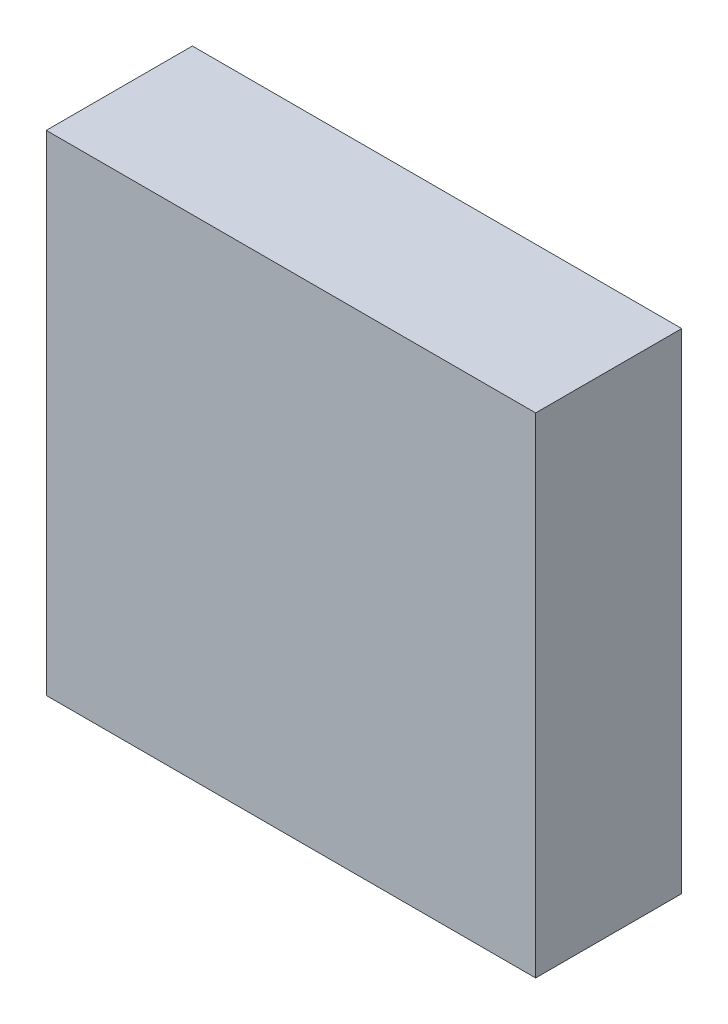
ISO-10303-21;
HEADER;
FILE_DESCRIPTION(('STEP AP214'),'2;1');
FILE_NAME('part.step','',(''),(''),'','','');
FILE_SCHEMA(('AUTOMOTIVE_DESIGN { 1 0 10303 214 1 1 1 1 }'));
ENDSEC;
DATA;
#1=APPLICATION_CONTEXT('core data for automotive mechanical design processes');
#2=APPLICATION_PROTOCOL_DEFINITION('international standard','automotive_design',2000,#1);
#3=PRODUCT_CONTEXT('',#1,'mechanical');
#4=PRODUCT('Part','Part','',(#3));
#5=PRODUCT_RELATED_PRODUCT_CATEGORY('part','',(#4));
#6=PRODUCT_DEFINITION_FORMATION('','',#4);
#7=PRODUCT_DEFINITION_CONTEXT('part definition',#1,'design');
#8=PRODUCT_DEFINITION('design','',#6,#7);
#9=PRODUCT_DEFINITION_SHAPE('','',#8);
#10=(LENGTH_UNIT() NAMED_UNIT(*) SI_UNIT(.MILLI.,.METRE.));
#11=(NAMED_UNIT(*) PLANE_ANGLE_UNIT() SI_UNIT($,.RADIAN.));
#12=(NAMED_UNIT(*) SI_UNIT($,.STERADIAN.) SOLID_ANGLE_UNIT());
#13=UNCERTAINTY_MEASURE_WITH_UNIT(LENGTH_MEASURE(1.E-05),#10,'distance_accuracy_value','');
#14=(GEOMETRIC_REPRESENTATION_CONTEXT(3) GLOBAL_UNCERTAINTY_ASSIGNED_CONTEXT((#13)) GLOBAL_UNIT_ASSIGNED_CONTEXT((#10,
#11,#12)) REPRESENTATION_CONTEXT('',''));
#15=CARTESIAN_POINT('',(0.,0.,0.));
#16=DIRECTION('',(0.,0.,1.));
#17=DIRECTION('',(1.,0.,0.));
#18=AXIS2_PLACEMENT_3D('',#15,#16,#17);
#19=CARTESIAN_POINT('',(8.8,-0.800000000000002,5.1));
#20=DIRECTION('',(1.,0.,0.));
#21=DIRECTION('',(0.,0.,-1.));
#22=AXIS2_PLACEMENT_3D('',#19,#20,#21);
#23=PLANE('',#22);
#24=DIRECTION('',(0.,0.,1.));
#25=VECTOR('',#24,1.);
#26=CARTESIAN_POINT('',(8.8,38.9386210493399,0.1));
#27=LINE('',#26,#25);
#28=CARTESIAN_POINT('',(8.8,38.9386210493399,1.6));
#29=VERTEX_POINT('',#28);
#30=CARTESIAN_POINT('',(8.8,38.9386210493398,5.1));
#31=VERTEX_POINT('',#30);
#32=EDGE_CURVE('E108',#29,#31,#27,.T.);
#33=ORIENTED_EDGE('',*,*,#32,.F.);
#34=DIRECTION('',(0.,1.,0.));
#35=VECTOR('',#34,1.);
#36=CARTESIAN_POINT('',(8.8,-0.800000000000002,1.6));
#37=LINE('',#36,#35);
#38=CARTESIAN_POINT('',(8.8,0.,1.6));
#39=VERTEX_POINT('',#38);
#40=EDGE_CURVE('E100',#39,#29,#37,.T.);
#41=ORIENTED_EDGE('',*,*,#40,.F.);
#42=DIRECTION('',(0.,0.,-1.));
#43=VECTOR('',#42,1.);
#44=CARTESIAN_POINT('',(8.8,0.,12.3));
#45=LINE('',#44,#43);
#46=CARTESIAN_POINT('',(8.8,0.,5.1));
#47=VERTEX_POINT('',#46);
#48=EDGE_CURVE('E129',#47,#39,#45,.T.);
#49=ORIENTED_EDGE('',*,*,#48,.F.);
#50=DIRECTION('',(0.,1.,0.));
#51=VECTOR('',#50,1.);
#52=CARTESIAN_POINT('',(8.8,-0.800000000000002,5.1));
#53=LINE('',#52,#51);
#54=EDGE_CURVE('E111',#47,#31,#53,.T.);
#55=ORIENTED_EDGE('',*,*,#54,.T.);
#56=EDGE_LOOP('',(#33,#41,#49,#55));
#57=FACE_BOUND('',#56,.T.);
#58=ADVANCED_FACE('F33',(#57),#23,.F.);
#59=CARTESIAN_POINT('',(2.2,-0.800000000000002,5.1));
#60=DIRECTION('',(0.,0.,1.));
#61=DIRECTION('',(1.,0.,0.));
#62=AXIS2_PLACEMENT_3D('',#59,#60,#61);
#63=PLANE('',#62);
#64=DIRECTION('',(-1.,0.,0.));
#65=VECTOR('',#64,1.);
#66=CARTESIAN_POINT('',(8.8,38.9386210493399,5.1));
#67=LINE('',#66,#65);
#68=CARTESIAN_POINT('',(2.2,38.9386210493398,5.1));
#69=VERTEX_POINT('',#68);
#70=EDGE_CURVE('E48',#31,#69,#67,.T.);
#71=ORIENTED_EDGE('',*,*,#70,.F.);
#72=ORIENTED_EDGE('',*,*,#54,.F.);
#73=DIRECTION('',(1.,0.,0.));
#74=VECTOR('',#73,1.);
#75=CARTESIAN_POINT('',(0.,0.,5.1));
#76=LINE('',#75,#74);
#77=CARTESIAN_POINT('',(2.2,0.,5.1));
#78=VERTEX_POINT('',#77);
#79=EDGE_CURVE('E126',#78,#47,#76,.T.);
#80=ORIENTED_EDGE('',*,*,#79,.F.);
#81=DIRECTION('',(0.,1.,0.));
#82=VECTOR('',#81,1.);
#83=CARTESIAN_POINT('',(2.2,-0.800000000000002,5.1));
#84=LINE('',#83,#82);
#85=EDGE_CURVE('E119',#78,#69,#84,.T.);
#86=ORIENTED_EDGE('',*,*,#85,.T.);
#87=EDGE_LOOP('',(#71,#72,#80,#86));
#88=FACE_BOUND('',#87,.T.);
#89=ADVANCED_FACE('F189',(#88),#63,.F.);
#90=CARTESIAN_POINT('',(2.2,-0.800000000000002,5.1));
#91=DIRECTION('',(-1.,0.,0.));
#92=DIRECTION('',(0.,0.,1.));
#93=AXIS2_PLACEMENT_3D('',#90,#91,#92);
#94=PLANE('',#93);
#95=DIRECTION('',(0.,0.,1.));
#96=VECTOR('',#95,1.);
#97=CARTESIAN_POINT('',(2.2,38.9386210493399,0.1));
#98=LINE('',#97,#96);
#99=CARTESIAN_POINT('',(2.2,38.9386210493398,1.6));
#100=VERTEX_POINT('',#99);
#101=EDGE_CURVE('E56',#100,#69,#98,.T.);
#102=ORIENTED_EDGE('',*,*,#101,.T.);
#103=ORIENTED_EDGE('',*,*,#85,.F.);
#104=DIRECTION('',(0.,0.,1.));
#105=VECTOR('',#104,1.);
#106=CARTESIAN_POINT('',(2.2,0.,12.3));
#107=LINE('',#106,#105);
#108=CARTESIAN_POINT('',(2.2,0.,1.6));
#109=VERTEX_POINT('',#108);
#110=EDGE_CURVE('E123',#109,#78,#107,.T.);
#111=ORIENTED_EDGE('',*,*,#110,.F.);
#112=DIRECTION('',(0.,1.,0.));
#113=VECTOR('',#112,1.);
#114=CARTESIAN_POINT('',(2.2,-0.800000000000002,1.6));
#115=LINE('',#114,#113);
#116=EDGE_CURVE('E107',#109,#100,#115,.T.);
#117=ORIENTED_EDGE('',*,*,#116,.T.);
#118=EDGE_LOOP('',(#102,#103,#111,#117));
#119=FACE_BOUND('',#118,.T.);
#120=ADVANCED_FACE('F193',(#119),#94,.F.);
#121=CARTESIAN_POINT('',(2.2,-0.800000000000002,1.6));
#122=DIRECTION('',(0.,0.,-1.));
#123=DIRECTION('',(-1.,0.,0.));
#124=AXIS2_PLACEMENT_3D('',#121,#122,#123);
#125=PLANE('',#124);
#126=DIRECTION('',(1.,0.,0.));
#127=VECTOR('',#126,1.);
#128=CARTESIAN_POINT('',(2.2,38.9386210493399,1.6));
#129=LINE('',#128,#127);
#130=EDGE_CURVE('E11',#100,#29,#129,.T.);
#131=ORIENTED_EDGE('',*,*,#130,.F.);
#132=ORIENTED_EDGE('',*,*,#116,.F.);
#133=DIRECTION('',(-1.,0.,0.));
#134=VECTOR('',#133,1.);
#135=CARTESIAN_POINT('',(0.,0.,1.6));
#136=LINE('',#135,#134);
#137=EDGE_CURVE('E104',#39,#109,#136,.T.);
#138=ORIENTED_EDGE('',*,*,#137,.F.);
#139=ORIENTED_EDGE('',*,*,#40,.T.);
#140=EDGE_LOOP('',(#131,#132,#138,#139));
#141=FACE_BOUND('',#140,.T.);
#142=ADVANCED_FACE('F102',(#141),#125,.F.);
#143=CARTESIAN_POINT('',(0.,0.,12.3));
#144=DIRECTION('',(1.,0.,0.));
#145=DIRECTION('',(0.,0.,-1.));
#146=AXIS2_PLACEMENT_3D('',#143,#144,#145);
#147=PLANE('',#146);
#148=DIRECTION('',(0.,-1.,0.));
#149=VECTOR('',#148,1.);
#150=CARTESIAN_POINT('',(0.,0.,0.));
#151=LINE('',#150,#149);
#152=CARTESIAN_POINT('',(0.,41.2,0.));
#153=VERTEX_POINT('',#152);
#154=CARTESIAN_POINT('',(0.,0.,0.));
#155=VERTEX_POINT('',#154);
#156=EDGE_CURVE('E131',#153,#155,#151,.T.);
#157=ORIENTED_EDGE('',*,*,#156,.T.);
#158=DIRECTION('',(0.,0.,-1.));
#159=VECTOR('',#158,1.);
#160=CARTESIAN_POINT('',(0.,0.,12.3));
#161=LINE('',#160,#159);
#162=CARTESIAN_POINT('',(0.,0.,12.3));
#163=VERTEX_POINT('',#162);
#164=EDGE_CURVE('E41',#163,#155,#161,.T.);
#165=ORIENTED_EDGE('',*,*,#164,.F.);
#166=DIRECTION('',(0.,-1.,0.));
#167=VECTOR('',#166,1.);
#168=CARTESIAN_POINT('',(0.,0.,12.3));
#169=LINE('',#168,#167);
#170=CARTESIAN_POINT('',(0.,41.2,12.3));
#171=VERTEX_POINT('',#170);
#172=EDGE_CURVE('E132',#171,#163,#169,.T.);
#173=ORIENTED_EDGE('',*,*,#172,.F.);
#174=DIRECTION('',(0.,0.,-1.));
#175=VECTOR('',#174,1.);
#176=CARTESIAN_POINT('',(0.,41.2,12.3));
#177=LINE('',#176,#175);
#178=EDGE_CURVE('E142',#171,#153,#177,.T.);
#179=ORIENTED_EDGE('',*,*,#178,.T.);
#180=EDGE_LOOP('',(#157,#165,#173,#179));
#181=FACE_BOUND('',#180,.T.);
#182=ADVANCED_FACE('F35',(#181),#147,.F.);
#183=CARTESIAN_POINT('',(0.,0.,12.3));
#184=DIRECTION('',(0.,1.,0.));
#185=DIRECTION('',(0.,0.,1.));
#186=AXIS2_PLACEMENT_3D('',#183,#184,#185);
#187=PLANE('',#186);
#188=ORIENTED_EDGE('',*,*,#79,.T.);
#189=ORIENTED_EDGE('',*,*,#48,.T.);
#190=ORIENTED_EDGE('',*,*,#137,.T.);
#191=ORIENTED_EDGE('',*,*,#110,.T.);
#192=EDGE_LOOP('',(#188,#189,#190,#191));
#193=FACE_BOUND('',#192,.T.);
#194=DIRECTION('',(1.,0.,0.));
#195=VECTOR('',#194,1.);
#196=CARTESIAN_POINT('',(0.,0.,0.));
#197=LINE('',#196,#195);
#198=CARTESIAN_POINT('',(41.2,0.,0.));
#199=VERTEX_POINT('',#198);
#200=EDGE_CURVE('E145',#155,#199,#197,.T.);
#201=ORIENTED_EDGE('',*,*,#200,.T.);
#202=DIRECTION('',(0.,0.,-1.));
#203=VECTOR('',#202,1.);
#204=CARTESIAN_POINT('',(41.2,0.,12.3));
#205=LINE('',#204,#203);
#206=CARTESIAN_POINT('',(41.2,0.,12.3));
#207=VERTEX_POINT('',#206);
#208=EDGE_CURVE('E155',#207,#199,#205,.T.);
#209=ORIENTED_EDGE('',*,*,#208,.F.);
#210=DIRECTION('',(1.,0.,0.));
#211=VECTOR('',#210,1.);
#212=CARTESIAN_POINT('',(0.,0.,12.3));
#213=LINE('',#212,#211);
#214=EDGE_CURVE('E135',#163,#207,#213,.T.);
#215=ORIENTED_EDGE('',*,*,#214,.F.);
#216=ORIENTED_EDGE('',*,*,#164,.T.);
#217=EDGE_LOOP('',(#201,#209,#215,#216));
#218=FACE_BOUND('',#217,.T.);
#219=ADVANCED_FACE('F160',(#193,#218),#187,.F.);
#220=CARTESIAN_POINT('',(41.2,0.,12.3));
#221=DIRECTION('',(-1.,0.,0.));
#222=DIRECTION('',(0.,0.,1.));
#223=AXIS2_PLACEMENT_3D('',#220,#221,#222);
#224=PLANE('',#223);
#225=DIRECTION('',(0.,1.,0.));
#226=VECTOR('',#225,1.);
#227=CARTESIAN_POINT('',(41.2,0.,0.));
#228=LINE('',#227,#226);
#229=CARTESIAN_POINT('',(41.2,41.2,0.));
#230=VERTEX_POINT('',#229);
#231=EDGE_CURVE('E147',#199,#230,#228,.T.);
#232=ORIENTED_EDGE('',*,*,#231,.T.);
#233=DIRECTION('',(0.,0.,-1.));
#234=VECTOR('',#233,1.);
#235=CARTESIAN_POINT('',(41.2,41.2,12.3));
#236=LINE('',#235,#234);
#237=CARTESIAN_POINT('',(41.2,41.2,12.3));
#238=VERTEX_POINT('',#237);
#239=EDGE_CURVE('E152',#238,#230,#236,.T.);
#240=ORIENTED_EDGE('',*,*,#239,.F.);
#241=DIRECTION('',(0.,1.,0.));
#242=VECTOR('',#241,1.);
#243=CARTESIAN_POINT('',(41.2,0.,12.3));
#244=LINE('',#243,#242);
#245=EDGE_CURVE('E138',#207,#238,#244,.T.);
#246=ORIENTED_EDGE('',*,*,#245,.F.);
#247=ORIENTED_EDGE('',*,*,#208,.T.);
#248=EDGE_LOOP('',(#232,#240,#246,#247));
#249=FACE_BOUND('',#248,.T.);
#250=ADVANCED_FACE('F172',(#249),#224,.F.);
#251=CARTESIAN_POINT('',(0.,41.2,12.3));
#252=DIRECTION('',(0.,-1.,0.));
#253=DIRECTION('',(0.,0.,-1.));
#254=AXIS2_PLACEMENT_3D('',#251,#252,#253);
#255=PLANE('',#254);
#256=DIRECTION('',(-1.,0.,0.));
#257=VECTOR('',#256,1.);
#258=CARTESIAN_POINT('',(0.,41.2,0.));
#259=LINE('',#258,#257);
#260=EDGE_CURVE('E136',#230,#153,#259,.T.);
#261=ORIENTED_EDGE('',*,*,#260,.T.);
#262=ORIENTED_EDGE('',*,*,#178,.F.);
#263=DIRECTION('',(-1.,0.,0.));
#264=VECTOR('',#263,1.);
#265=CARTESIAN_POINT('',(0.,41.2,12.3));
#266=LINE('',#265,#264);
#267=EDGE_CURVE('E140',#238,#171,#266,.T.);
#268=ORIENTED_EDGE('',*,*,#267,.F.);
#269=ORIENTED_EDGE('',*,*,#239,.T.);
#270=EDGE_LOOP('',(#261,#262,#268,#269));
#271=FACE_BOUND('',#270,.T.);
#272=ADVANCED_FACE('F176',(#271),#255,.F.);
#273=CARTESIAN_POINT('',(0.,0.,12.3));
#274=DIRECTION('',(0.,0.,-1.));
#275=DIRECTION('',(-1.,0.,0.));
#276=AXIS2_PLACEMENT_3D('',#273,#274,#275);
#277=PLANE('',#276);
#278=ORIENTED_EDGE('',*,*,#172,.T.);
#279=ORIENTED_EDGE('',*,*,#214,.T.);
#280=ORIENTED_EDGE('',*,*,#245,.T.);
#281=ORIENTED_EDGE('',*,*,#267,.T.);
#282=EDGE_LOOP('',(#278,#279,#280,#281));
#283=FACE_BOUND('',#282,.T.);
#284=ADVANCED_FACE('F178',(#283),#277,.F.);
#285=CARTESIAN_POINT('',(0.,0.,0.));
#286=DIRECTION('',(0.,0.,-1.));
#287=DIRECTION('',(-1.,0.,0.));
#288=AXIS2_PLACEMENT_3D('',#285,#286,#287);
#289=PLANE('',#288);
#290=ORIENTED_EDGE('',*,*,#156,.F.);
#291=ORIENTED_EDGE('',*,*,#260,.F.);
#292=ORIENTED_EDGE('',*,*,#231,.F.);
#293=ORIENTED_EDGE('',*,*,#200,.F.);
#294=EDGE_LOOP('',(#290,#291,#292,#293));
#295=FACE_BOUND('',#294,.T.);
#296=ADVANCED_FACE('F168',(#295),#289,.T.);
#297=CARTESIAN_POINT('',(8.8,38.9386210493399,0.1));
#298=DIRECTION('',(0.,1.,0.));
#299=DIRECTION('',(0.,0.,1.));
#300=AXIS2_PLACEMENT_3D('',#297,#298,#299);
#301=PLANE('',#300);
#302=ORIENTED_EDGE('',*,*,#101,.F.);
#303=ORIENTED_EDGE('',*,*,#130,.T.);
#304=ORIENTED_EDGE('',*,*,#32,.T.);
#305=ORIENTED_EDGE('',*,*,#70,.T.);
#306=EDGE_LOOP('',(#302,#303,#304,#305));
#307=FACE_BOUND('',#306,.T.);
#308=ADVANCED_FACE('F114',(#307),#301,.F.);
#309=CLOSED_SHELL('',(#58,#89,#120,#142,#182,#219,#250,#272,#284,#296,#308));
#310=MANIFOLD_SOLID_BREP('B2',#309);
#311=ADVANCED_BREP_SHAPE_REPRESENTATION('',(#18,#310),#14);
#312=SHAPE_DEFINITION_REPRESENTATION(#9,#311);
ENDSEC;
END-ISO-10303-21;
